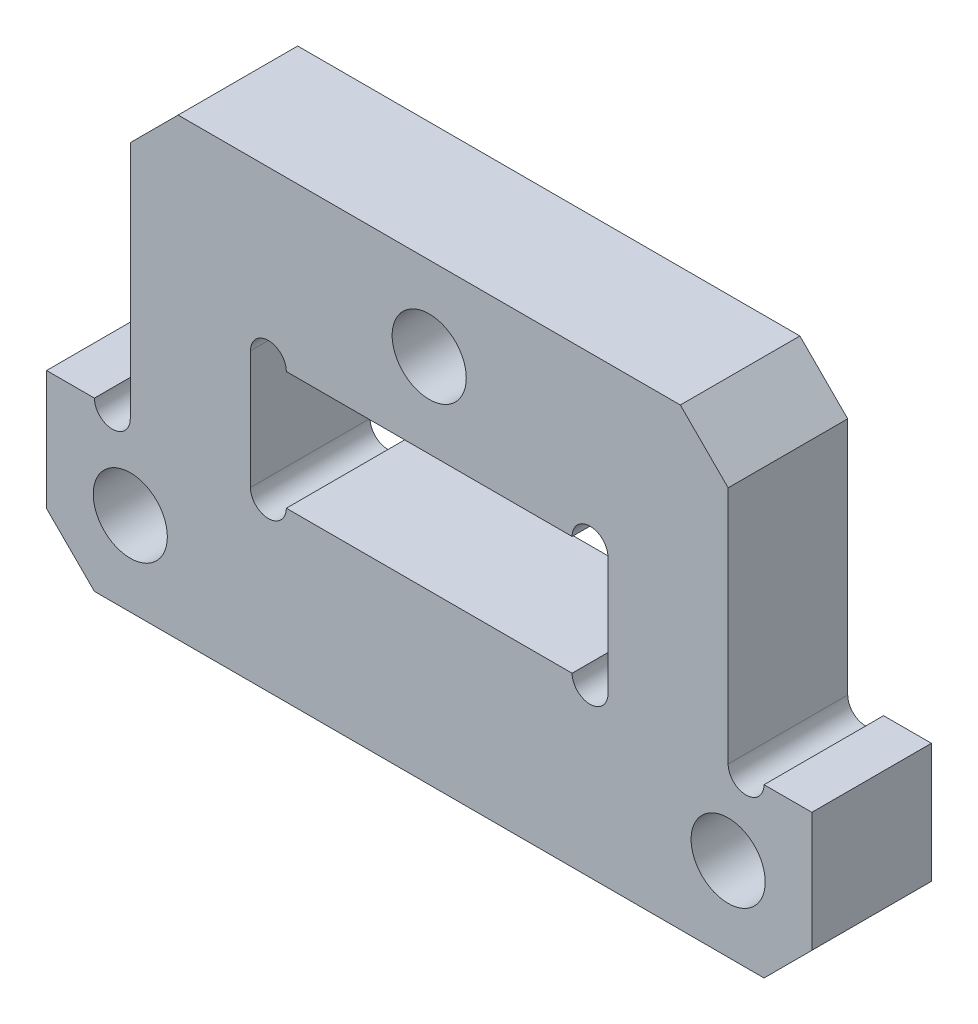
ISO-10303-21;
HEADER;
FILE_DESCRIPTION(('STEP AP214'),'2;1');
FILE_NAME('part.step','',(''),(''),'','','');
FILE_SCHEMA(('AUTOMOTIVE_DESIGN { 1 0 10303 214 1 1 1 1 }'));
ENDSEC;
DATA;
#1=APPLICATION_CONTEXT('core data for automotive mechanical design processes');
#2=APPLICATION_PROTOCOL_DEFINITION('international standard','automotive_design',2000,#1);
#3=PRODUCT_CONTEXT('',#1,'mechanical');
#4=PRODUCT('Part','Part','',(#3));
#5=PRODUCT_RELATED_PRODUCT_CATEGORY('part','',(#4));
#6=PRODUCT_DEFINITION_FORMATION('','',#4);
#7=PRODUCT_DEFINITION_CONTEXT('part definition',#1,'design');
#8=PRODUCT_DEFINITION('design','',#6,#7);
#9=PRODUCT_DEFINITION_SHAPE('','',#8);
#10=(LENGTH_UNIT() NAMED_UNIT(*) SI_UNIT(.MILLI.,.METRE.));
#11=(NAMED_UNIT(*) PLANE_ANGLE_UNIT() SI_UNIT($,.RADIAN.));
#12=(NAMED_UNIT(*) SI_UNIT($,.STERADIAN.) SOLID_ANGLE_UNIT());
#13=UNCERTAINTY_MEASURE_WITH_UNIT(LENGTH_MEASURE(1.E-05),#10,'distance_accuracy_value','');
#14=(GEOMETRIC_REPRESENTATION_CONTEXT(3) GLOBAL_UNCERTAINTY_ASSIGNED_CONTEXT((#13)) GLOBAL_UNIT_ASSIGNED_CONTEXT((#10,
#11,#12)) REPRESENTATION_CONTEXT('',''));
#15=CARTESIAN_POINT('',(0.,0.,0.));
#16=DIRECTION('',(0.,0.,1.));
#17=DIRECTION('',(1.,0.,0.));
#18=AXIS2_PLACEMENT_3D('',#15,#16,#17);
#19=CARTESIAN_POINT('',(0.,0.,2.5));
#20=DIRECTION('',(0.,0.,1.));
#21=DIRECTION('',(1.,0.,0.));
#22=AXIS2_PLACEMENT_3D('',#19,#20,#21);
#23=PLANE('',#22);
#24=DIRECTION('',(0.,1.,0.));
#25=VECTOR('',#24,1.);
#26=CARTESIAN_POINT('',(12.5,-2.5,2.5));
#27=LINE('',#26,#25);
#28=CARTESIAN_POINT('',(12.5,-2.5,2.5));
#29=VERTEX_POINT('',#28);
#30=CARTESIAN_POINT('',(12.5,7.49999999999999,2.5));
#31=VERTEX_POINT('',#30);
#32=EDGE_CURVE('E246',#29,#31,#27,.T.);
#33=ORIENTED_EDGE('',*,*,#32,.T.);
#34=DIRECTION('',(0.707106781186546,-0.707106781186549,0.));
#35=VECTOR('',#34,1.);
#36=CARTESIAN_POINT('',(10.,9.99999999999998,2.5));
#37=LINE('',#36,#35);
#38=CARTESIAN_POINT('',(10.5,9.5,2.5));
#39=VERTEX_POINT('',#38);
#40=EDGE_CURVE('E317',#31,#39,#37,.F.);
#41=ORIENTED_EDGE('',*,*,#40,.T.);
#42=DIRECTION('',(-1.,0.,0.));
#43=VECTOR('',#42,1.);
#44=CARTESIAN_POINT('',(12.5,9.5,2.5));
#45=LINE('',#44,#43);
#46=CARTESIAN_POINT('',(-10.5,9.5,2.5));
#47=VERTEX_POINT('',#46);
#48=EDGE_CURVE('E249',#39,#47,#45,.T.);
#49=ORIENTED_EDGE('',*,*,#48,.T.);
#50=DIRECTION('',(0.707106781186549,0.707106781186546,0.));
#51=VECTOR('',#50,1.);
#52=CARTESIAN_POINT('',(-9.99999999999998,10.,2.5));
#53=LINE('',#52,#51);
#54=CARTESIAN_POINT('',(-12.5,7.49999999999999,2.5));
#55=VERTEX_POINT('',#54);
#56=EDGE_CURVE('E51',#47,#55,#53,.F.);
#57=ORIENTED_EDGE('',*,*,#56,.T.);
#58=DIRECTION('',(0.,-1.,0.));
#59=VECTOR('',#58,1.);
#60=CARTESIAN_POINT('',(-12.5,-2.5,2.5));
#61=LINE('',#60,#59);
#62=CARTESIAN_POINT('',(-12.5,-2.5,2.5));
#63=VERTEX_POINT('',#62);
#64=EDGE_CURVE('E251',#55,#63,#61,.T.);
#65=ORIENTED_EDGE('',*,*,#64,.T.);
#66=CARTESIAN_POINT('',(-13.25,-2.5,2.5));
#67=DIRECTION('',(0.,0.,1.));
#68=DIRECTION('',(1.,0.,0.));
#69=AXIS2_PLACEMENT_3D('',#66,#67,#68);
#70=CIRCLE('',#69,0.75);
#71=CARTESIAN_POINT('',(-14.,-2.5,2.5));
#72=VERTEX_POINT('',#71);
#73=EDGE_CURVE('E383',#72,#63,#70,.T.);
#74=ORIENTED_EDGE('',*,*,#73,.F.);
#75=DIRECTION('',(-1.,0.,0.));
#76=VECTOR('',#75,1.);
#77=CARTESIAN_POINT('',(-16.,-2.5,2.5));
#78=LINE('',#77,#76);
#79=CARTESIAN_POINT('',(-16.,-2.5,2.5));
#80=VERTEX_POINT('',#79);
#81=EDGE_CURVE('E253',#72,#80,#78,.T.);
#82=ORIENTED_EDGE('',*,*,#81,.T.);
#83=DIRECTION('',(0.,-1.,0.));
#84=VECTOR('',#83,1.);
#85=CARTESIAN_POINT('',(-16.,-2.5,2.5));
#86=LINE('',#85,#84);
#87=CARTESIAN_POINT('',(-16.,-7.49999999999998,2.5));
#88=VERTEX_POINT('',#87);
#89=EDGE_CURVE('E255',#80,#88,#86,.T.);
#90=ORIENTED_EDGE('',*,*,#89,.T.);
#91=DIRECTION('',(-0.707106781186546,0.707106781186549,0.));
#92=VECTOR('',#91,1.);
#93=CARTESIAN_POINT('',(-11.75,-11.75,2.5));
#94=LINE('',#93,#92);
#95=CARTESIAN_POINT('',(-14.,-9.5,2.5));
#96=VERTEX_POINT('',#95);
#97=EDGE_CURVE('E313',#88,#96,#94,.F.);
#98=ORIENTED_EDGE('',*,*,#97,.T.);
#99=DIRECTION('',(1.,0.,0.));
#100=VECTOR('',#99,1.);
#101=CARTESIAN_POINT('',(-16.,-9.5,2.5));
#102=LINE('',#101,#100);
#103=CARTESIAN_POINT('',(14.,-9.5,2.5));
#104=VERTEX_POINT('',#103);
#105=EDGE_CURVE('E238',#96,#104,#102,.T.);
#106=ORIENTED_EDGE('',*,*,#105,.T.);
#107=DIRECTION('',(-0.707106781186549,-0.707106781186546,0.));
#108=VECTOR('',#107,1.);
#109=CARTESIAN_POINT('',(11.75,-11.75,2.5));
#110=LINE('',#109,#108);
#111=CARTESIAN_POINT('',(16.,-7.49999999999999,2.5));
#112=VERTEX_POINT('',#111);
#113=EDGE_CURVE('E58',#104,#112,#110,.F.);
#114=ORIENTED_EDGE('',*,*,#113,.T.);
#115=DIRECTION('',(0.,1.,0.));
#116=VECTOR('',#115,1.);
#117=CARTESIAN_POINT('',(16.,-9.5,2.5));
#118=LINE('',#117,#116);
#119=CARTESIAN_POINT('',(16.,-2.5,2.5));
#120=VERTEX_POINT('',#119);
#121=EDGE_CURVE('E240',#112,#120,#118,.T.);
#122=ORIENTED_EDGE('',*,*,#121,.T.);
#123=DIRECTION('',(-1.,0.,0.));
#124=VECTOR('',#123,1.);
#125=CARTESIAN_POINT('',(16.,-2.5,2.5));
#126=LINE('',#125,#124);
#127=CARTESIAN_POINT('',(14.,-2.5,2.5));
#128=VERTEX_POINT('',#127);
#129=EDGE_CURVE('E243',#120,#128,#126,.T.);
#130=ORIENTED_EDGE('',*,*,#129,.T.);
#131=CARTESIAN_POINT('',(13.25,-2.5,2.5));
#132=DIRECTION('',(0.,0.,1.));
#133=DIRECTION('',(1.,0.,0.));
#134=AXIS2_PLACEMENT_3D('',#131,#132,#133);
#135=CIRCLE('',#134,0.75);
#136=EDGE_CURVE('E355',#29,#128,#135,.T.);
#137=ORIENTED_EDGE('',*,*,#136,.F.);
#138=EDGE_LOOP('',(#33,#41,#49,#57,#65,#74,#82,#90,#98,#106,#114,#122,#130,#137));
#139=FACE_BOUND('',#138,.T.);
#140=CARTESIAN_POINT('',(-6.725,-2.475,2.5));
#141=DIRECTION('',(0.,0.,1.));
#142=DIRECTION('',(1.,0.,0.));
#143=AXIS2_PLACEMENT_3D('',#140,#141,#142);
#144=CIRCLE('',#143,0.75);
#145=CARTESIAN_POINT('',(-7.475,-2.475,2.5));
#146=VERTEX_POINT('',#145);
#147=CARTESIAN_POINT('',(-5.975,-2.475,2.5));
#148=VERTEX_POINT('',#147);
#149=EDGE_CURVE('E392',#146,#148,#144,.T.);
#150=ORIENTED_EDGE('',*,*,#149,.F.);
#151=DIRECTION('',(0.,-1.,0.));
#152=VECTOR('',#151,1.);
#153=CARTESIAN_POINT('',(-7.475,-2.475,2.5));
#154=LINE('',#153,#152);
#155=CARTESIAN_POINT('',(-7.475,2.475,2.5));
#156=VERTEX_POINT('',#155);
#157=EDGE_CURVE('E216',#156,#146,#154,.T.);
#158=ORIENTED_EDGE('',*,*,#157,.F.);
#159=CARTESIAN_POINT('',(-6.725,2.475,2.5));
#160=DIRECTION('',(0.,0.,1.));
#161=DIRECTION('',(1.,0.,0.));
#162=AXIS2_PLACEMENT_3D('',#159,#160,#161);
#163=CIRCLE('',#162,0.75);
#164=CARTESIAN_POINT('',(-5.975,2.475,2.5));
#165=VERTEX_POINT('',#164);
#166=EDGE_CURVE('E397',#165,#156,#163,.T.);
#167=ORIENTED_EDGE('',*,*,#166,.F.);
#168=DIRECTION('',(-1.,0.,0.));
#169=VECTOR('',#168,1.);
#170=CARTESIAN_POINT('',(7.475,2.475,2.5));
#171=LINE('',#170,#169);
#172=CARTESIAN_POINT('',(5.975,2.475,2.5));
#173=VERTEX_POINT('',#172);
#174=EDGE_CURVE('E207',#173,#165,#171,.T.);
#175=ORIENTED_EDGE('',*,*,#174,.F.);
#176=CARTESIAN_POINT('',(6.725,2.475,2.5));
#177=DIRECTION('',(0.,0.,1.));
#178=DIRECTION('',(1.,0.,0.));
#179=AXIS2_PLACEMENT_3D('',#176,#177,#178);
#180=CIRCLE('',#179,0.75);
#181=CARTESIAN_POINT('',(7.475,2.475,2.5));
#182=VERTEX_POINT('',#181);
#183=EDGE_CURVE('E187',#182,#173,#180,.T.);
#184=ORIENTED_EDGE('',*,*,#183,.F.);
#185=DIRECTION('',(0.,1.,0.));
#186=VECTOR('',#185,1.);
#187=CARTESIAN_POINT('',(7.475,-2.475,2.5));
#188=LINE('',#187,#186);
#189=CARTESIAN_POINT('',(7.475,-2.475,2.5));
#190=VERTEX_POINT('',#189);
#191=EDGE_CURVE('E204',#190,#182,#188,.T.);
#192=ORIENTED_EDGE('',*,*,#191,.F.);
#193=CARTESIAN_POINT('',(6.725,-2.475,2.5));
#194=DIRECTION('',(0.,0.,1.));
#195=DIRECTION('',(1.,0.,0.));
#196=AXIS2_PLACEMENT_3D('',#193,#194,#195);
#197=CIRCLE('',#196,0.75);
#198=CARTESIAN_POINT('',(5.975,-2.475,2.5));
#199=VERTEX_POINT('',#198);
#200=EDGE_CURVE('E402',#199,#190,#197,.T.);
#201=ORIENTED_EDGE('',*,*,#200,.F.);
#202=DIRECTION('',(1.,0.,0.));
#203=VECTOR('',#202,1.);
#204=CARTESIAN_POINT('',(7.475,-2.475,2.5));
#205=LINE('',#204,#203);
#206=EDGE_CURVE('E212',#148,#199,#205,.T.);
#207=ORIENTED_EDGE('',*,*,#206,.F.);
#208=EDGE_LOOP('',(#150,#158,#167,#175,#184,#192,#201,#207));
#209=FACE_BOUND('',#208,.T.);
#210=CARTESIAN_POINT('',(12.5,-6.,2.5));
#211=DIRECTION('',(0.,0.,1.));
#212=DIRECTION('',(1.,0.,0.));
#213=AXIS2_PLACEMENT_3D('',#210,#211,#212);
#214=CIRCLE('',#213,1.55);
#215=CARTESIAN_POINT('',(14.05,-6.,2.5));
#216=VERTEX_POINT('',#215);
#217=EDGE_CURVE('E413',#216,#216,#214,.T.);
#218=ORIENTED_EDGE('',*,*,#217,.F.);
#219=EDGE_LOOP('',(#218));
#220=FACE_BOUND('',#219,.T.);
#221=CARTESIAN_POINT('',(-12.5,-6.,2.5));
#222=DIRECTION('',(0.,0.,1.));
#223=DIRECTION('',(1.,0.,0.));
#224=AXIS2_PLACEMENT_3D('',#221,#222,#223);
#225=CIRCLE('',#224,1.55);
#226=CARTESIAN_POINT('',(-10.95,-6.,2.5));
#227=VERTEX_POINT('',#226);
#228=EDGE_CURVE('E224',#227,#227,#225,.T.);
#229=ORIENTED_EDGE('',*,*,#228,.F.);
#230=EDGE_LOOP('',(#229));
#231=FACE_BOUND('',#230,.T.);
#232=CARTESIAN_POINT('',(0.,6.,2.5));
#233=DIRECTION('',(0.,0.,1.));
#234=DIRECTION('',(1.,0.,0.));
#235=AXIS2_PLACEMENT_3D('',#232,#233,#234);
#236=CIRCLE('',#235,1.55);
#237=CARTESIAN_POINT('',(1.55,6.,2.5));
#238=VERTEX_POINT('',#237);
#239=EDGE_CURVE('E407',#238,#238,#236,.T.);
#240=ORIENTED_EDGE('',*,*,#239,.F.);
#241=EDGE_LOOP('',(#240));
#242=FACE_BOUND('',#241,.T.);
#243=ADVANCED_FACE('F35',(#139,#209,#220,#231,#242),#23,.T.);
#244=CARTESIAN_POINT('',(0.,0.,-2.5));
#245=DIRECTION('',(0.,0.,1.));
#246=DIRECTION('',(1.,0.,0.));
#247=AXIS2_PLACEMENT_3D('',#244,#245,#246);
#248=PLANE('',#247);
#249=DIRECTION('',(-1.,0.,0.));
#250=VECTOR('',#249,1.);
#251=CARTESIAN_POINT('',(12.5,9.5,-2.5));
#252=LINE('',#251,#250);
#253=CARTESIAN_POINT('',(10.5,9.5,-2.5));
#254=VERTEX_POINT('',#253);
#255=CARTESIAN_POINT('',(-10.5,9.5,-2.5));
#256=VERTEX_POINT('',#255);
#257=EDGE_CURVE('E269',#254,#256,#252,.T.);
#258=ORIENTED_EDGE('',*,*,#257,.F.);
#259=DIRECTION('',(-0.707106781186546,0.707106781186549,0.));
#260=VECTOR('',#259,1.);
#261=CARTESIAN_POINT('',(10.5,9.5,-2.5));
#262=LINE('',#261,#260);
#263=CARTESIAN_POINT('',(12.5,7.49999999999999,-2.5));
#264=VERTEX_POINT('',#263);
#265=EDGE_CURVE('E309',#254,#264,#262,.F.);
#266=ORIENTED_EDGE('',*,*,#265,.T.);
#267=DIRECTION('',(0.,1.,0.));
#268=VECTOR('',#267,1.);
#269=CARTESIAN_POINT('',(12.5,-2.5,-2.5));
#270=LINE('',#269,#268);
#271=CARTESIAN_POINT('',(12.5,-2.5,-2.5));
#272=VERTEX_POINT('',#271);
#273=EDGE_CURVE('E266',#272,#264,#270,.T.);
#274=ORIENTED_EDGE('',*,*,#273,.F.);
#275=CARTESIAN_POINT('',(13.25,-2.5,-2.5));
#276=DIRECTION('',(0.,0.,1.));
#277=DIRECTION('',(1.,0.,0.));
#278=AXIS2_PLACEMENT_3D('',#275,#276,#277);
#279=CIRCLE('',#278,0.75);
#280=CARTESIAN_POINT('',(14.,-2.5,-2.5));
#281=VERTEX_POINT('',#280);
#282=EDGE_CURVE('E348',#272,#281,#279,.T.);
#283=ORIENTED_EDGE('',*,*,#282,.T.);
#284=DIRECTION('',(-1.,0.,0.));
#285=VECTOR('',#284,1.);
#286=CARTESIAN_POINT('',(16.,-2.5,-2.5));
#287=LINE('',#286,#285);
#288=CARTESIAN_POINT('',(16.,-2.5,-2.5));
#289=VERTEX_POINT('',#288);
#290=EDGE_CURVE('E263',#289,#281,#287,.T.);
#291=ORIENTED_EDGE('',*,*,#290,.F.);
#292=DIRECTION('',(0.,1.,0.));
#293=VECTOR('',#292,1.);
#294=CARTESIAN_POINT('',(16.,-9.5,-2.5));
#295=LINE('',#294,#293);
#296=CARTESIAN_POINT('',(16.,-7.49999999999999,-2.5));
#297=VERTEX_POINT('',#296);
#298=EDGE_CURVE('E261',#297,#289,#295,.T.);
#299=ORIENTED_EDGE('',*,*,#298,.F.);
#300=DIRECTION('',(0.707106781186549,0.707106781186546,0.));
#301=VECTOR('',#300,1.);
#302=CARTESIAN_POINT('',(16.,-7.49999999999999,-2.5));
#303=LINE('',#302,#301);
#304=CARTESIAN_POINT('',(14.,-9.5,-2.5));
#305=VERTEX_POINT('',#304);
#306=EDGE_CURVE('E305',#297,#305,#303,.F.);
#307=ORIENTED_EDGE('',*,*,#306,.T.);
#308=DIRECTION('',(1.,0.,0.));
#309=VECTOR('',#308,1.);
#310=CARTESIAN_POINT('',(-16.,-9.5,-2.5));
#311=LINE('',#310,#309);
#312=CARTESIAN_POINT('',(-14.,-9.5,-2.5));
#313=VERTEX_POINT('',#312);
#314=EDGE_CURVE('E237',#313,#305,#311,.T.);
#315=ORIENTED_EDGE('',*,*,#314,.F.);
#316=DIRECTION('',(0.707106781186546,-0.707106781186549,0.));
#317=VECTOR('',#316,1.);
#318=CARTESIAN_POINT('',(-14.,-9.5,-2.5));
#319=LINE('',#318,#317);
#320=CARTESIAN_POINT('',(-16.,-7.49999999999998,-2.5));
#321=VERTEX_POINT('',#320);
#322=EDGE_CURVE('E303',#313,#321,#319,.F.);
#323=ORIENTED_EDGE('',*,*,#322,.T.);
#324=DIRECTION('',(0.,-1.,0.));
#325=VECTOR('',#324,1.);
#326=CARTESIAN_POINT('',(-16.,-2.5,-2.5));
#327=LINE('',#326,#325);
#328=CARTESIAN_POINT('',(-16.,-2.5,-2.5));
#329=VERTEX_POINT('',#328);
#330=EDGE_CURVE('E241',#329,#321,#327,.T.);
#331=ORIENTED_EDGE('',*,*,#330,.F.);
#332=DIRECTION('',(-1.,0.,0.));
#333=VECTOR('',#332,1.);
#334=CARTESIAN_POINT('',(-16.,-2.5,-2.5));
#335=LINE('',#334,#333);
#336=CARTESIAN_POINT('',(-14.,-2.5,-2.5));
#337=VERTEX_POINT('',#336);
#338=EDGE_CURVE('E274',#337,#329,#335,.T.);
#339=ORIENTED_EDGE('',*,*,#338,.F.);
#340=CARTESIAN_POINT('',(-13.25,-2.5,-2.5));
#341=DIRECTION('',(0.,0.,1.));
#342=DIRECTION('',(1.,0.,0.));
#343=AXIS2_PLACEMENT_3D('',#340,#341,#342);
#344=CIRCLE('',#343,0.75);
#345=CARTESIAN_POINT('',(-12.5,-2.5,-2.5));
#346=VERTEX_POINT('',#345);
#347=EDGE_CURVE('E379',#337,#346,#344,.T.);
#348=ORIENTED_EDGE('',*,*,#347,.T.);
#349=DIRECTION('',(0.,-1.,0.));
#350=VECTOR('',#349,1.);
#351=CARTESIAN_POINT('',(-12.5,-2.5,-2.5));
#352=LINE('',#351,#350);
#353=CARTESIAN_POINT('',(-12.5,7.49999999999999,-2.5));
#354=VERTEX_POINT('',#353);
#355=EDGE_CURVE('E272',#354,#346,#352,.T.);
#356=ORIENTED_EDGE('',*,*,#355,.F.);
#357=DIRECTION('',(-0.707106781186549,-0.707106781186546,0.));
#358=VECTOR('',#357,1.);
#359=CARTESIAN_POINT('',(-12.5,7.49999999999999,-2.5));
#360=LINE('',#359,#358);
#361=EDGE_CURVE('E307',#354,#256,#360,.F.);
#362=ORIENTED_EDGE('',*,*,#361,.T.);
#363=EDGE_LOOP('',(#258,#266,#274,#283,#291,#299,#307,#315,#323,#331,#339,#348,#356,#362));
#364=FACE_BOUND('',#363,.T.);
#365=DIRECTION('',(0.,-1.,0.));
#366=VECTOR('',#365,1.);
#367=CARTESIAN_POINT('',(-7.475,-2.475,-2.5));
#368=LINE('',#367,#366);
#369=CARTESIAN_POINT('',(-7.475,2.475,-2.5));
#370=VERTEX_POINT('',#369);
#371=CARTESIAN_POINT('',(-7.475,-2.475,-2.5));
#372=VERTEX_POINT('',#371);
#373=EDGE_CURVE('E220',#370,#372,#368,.T.);
#374=ORIENTED_EDGE('',*,*,#373,.T.);
#375=CARTESIAN_POINT('',(-6.725,-2.475,-2.5));
#376=DIRECTION('',(0.,0.,1.));
#377=DIRECTION('',(1.,0.,0.));
#378=AXIS2_PLACEMENT_3D('',#375,#376,#377);
#379=CIRCLE('',#378,0.75);
#380=CARTESIAN_POINT('',(-5.975,-2.475,-2.5));
#381=VERTEX_POINT('',#380);
#382=EDGE_CURVE('E387',#372,#381,#379,.T.);
#383=ORIENTED_EDGE('',*,*,#382,.T.);
#384=DIRECTION('',(1.,0.,0.));
#385=VECTOR('',#384,1.);
#386=CARTESIAN_POINT('',(7.475,-2.475,-2.5));
#387=LINE('',#386,#385);
#388=CARTESIAN_POINT('',(5.975,-2.475,-2.5));
#389=VERTEX_POINT('',#388);
#390=EDGE_CURVE('E223',#381,#389,#387,.T.);
#391=ORIENTED_EDGE('',*,*,#390,.T.);
#392=CARTESIAN_POINT('',(6.725,-2.475,-2.5));
#393=DIRECTION('',(0.,0.,1.));
#394=DIRECTION('',(1.,0.,0.));
#395=AXIS2_PLACEMENT_3D('',#392,#393,#394);
#396=CIRCLE('',#395,0.75);
#397=CARTESIAN_POINT('',(7.475,-2.475,-2.5));
#398=VERTEX_POINT('',#397);
#399=EDGE_CURVE('E208',#389,#398,#396,.T.);
#400=ORIENTED_EDGE('',*,*,#399,.T.);
#401=DIRECTION('',(0.,1.,0.));
#402=VECTOR('',#401,1.);
#403=CARTESIAN_POINT('',(7.475,-2.475,-2.5));
#404=LINE('',#403,#402);
#405=CARTESIAN_POINT('',(7.475,2.475,-2.5));
#406=VERTEX_POINT('',#405);
#407=EDGE_CURVE('E227',#398,#406,#404,.T.);
#408=ORIENTED_EDGE('',*,*,#407,.T.);
#409=CARTESIAN_POINT('',(6.725,2.475,-2.5));
#410=DIRECTION('',(0.,0.,1.));
#411=DIRECTION('',(1.,0.,0.));
#412=AXIS2_PLACEMENT_3D('',#409,#410,#411);
#413=CIRCLE('',#412,0.75);
#414=CARTESIAN_POINT('',(5.975,2.475,-2.5));
#415=VERTEX_POINT('',#414);
#416=EDGE_CURVE('E190',#406,#415,#413,.T.);
#417=ORIENTED_EDGE('',*,*,#416,.T.);
#418=DIRECTION('',(-1.,0.,0.));
#419=VECTOR('',#418,1.);
#420=CARTESIAN_POINT('',(7.475,2.475,-2.5));
#421=LINE('',#420,#419);
#422=CARTESIAN_POINT('',(-5.975,2.475,-2.5));
#423=VERTEX_POINT('',#422);
#424=EDGE_CURVE('E229',#415,#423,#421,.T.);
#425=ORIENTED_EDGE('',*,*,#424,.T.);
#426=CARTESIAN_POINT('',(-6.725,2.475,-2.5));
#427=DIRECTION('',(0.,0.,1.));
#428=DIRECTION('',(1.,0.,0.));
#429=AXIS2_PLACEMENT_3D('',#426,#427,#428);
#430=CIRCLE('',#429,0.75);
#431=EDGE_CURVE('E394',#423,#370,#430,.T.);
#432=ORIENTED_EDGE('',*,*,#431,.T.);
#433=EDGE_LOOP('',(#374,#383,#391,#400,#408,#417,#425,#432));
#434=FACE_BOUND('',#433,.T.);
#435=CARTESIAN_POINT('',(-12.5,-6.,-2.5));
#436=DIRECTION('',(0.,0.,1.));
#437=DIRECTION('',(1.,0.,0.));
#438=AXIS2_PLACEMENT_3D('',#435,#436,#437);
#439=CIRCLE('',#438,1.55);
#440=CARTESIAN_POINT('',(-10.95,-6.,-2.5));
#441=VERTEX_POINT('',#440);
#442=EDGE_CURVE('E416',#441,#441,#439,.T.);
#443=ORIENTED_EDGE('',*,*,#442,.T.);
#444=EDGE_LOOP('',(#443));
#445=FACE_BOUND('',#444,.T.);
#446=CARTESIAN_POINT('',(12.5,-6.,-2.5));
#447=DIRECTION('',(0.,0.,1.));
#448=DIRECTION('',(1.,0.,0.));
#449=AXIS2_PLACEMENT_3D('',#446,#447,#448);
#450=CIRCLE('',#449,1.55);
#451=CARTESIAN_POINT('',(14.05,-6.,-2.5));
#452=VERTEX_POINT('',#451);
#453=EDGE_CURVE('E410',#452,#452,#450,.T.);
#454=ORIENTED_EDGE('',*,*,#453,.T.);
#455=EDGE_LOOP('',(#454));
#456=FACE_BOUND('',#455,.T.);
#457=CARTESIAN_POINT('',(0.,6.,-2.5));
#458=DIRECTION('',(0.,0.,1.));
#459=DIRECTION('',(1.,0.,0.));
#460=AXIS2_PLACEMENT_3D('',#457,#458,#459);
#461=CIRCLE('',#460,1.55);
#462=CARTESIAN_POINT('',(1.55,6.,-2.5));
#463=VERTEX_POINT('',#462);
#464=EDGE_CURVE('E406',#463,#463,#461,.T.);
#465=ORIENTED_EDGE('',*,*,#464,.T.);
#466=EDGE_LOOP('',(#465));
#467=FACE_BOUND('',#466,.T.);
#468=ADVANCED_FACE('F344',(#364,#434,#445,#456,#467),#248,.F.);
#469=CARTESIAN_POINT('',(-16.,-9.5,2.5));
#470=DIRECTION('',(0.,1.,0.));
#471=DIRECTION('',(0.,0.,1.));
#472=AXIS2_PLACEMENT_3D('',#469,#470,#471);
#473=PLANE('',#472);
#474=ORIENTED_EDGE('',*,*,#314,.T.);
#475=DIRECTION('',(0.,0.,1.));
#476=VECTOR('',#475,1.);
#477=CARTESIAN_POINT('',(14.,-9.5,2.5));
#478=LINE('',#477,#476);
#479=EDGE_CURVE('E44',#305,#104,#478,.T.);
#480=ORIENTED_EDGE('',*,*,#479,.T.);
#481=ORIENTED_EDGE('',*,*,#105,.F.);
#482=DIRECTION('',(0.,0.,-1.));
#483=VECTOR('',#482,1.);
#484=CARTESIAN_POINT('',(-14.,-9.5,2.5));
#485=LINE('',#484,#483);
#486=EDGE_CURVE('E325',#96,#313,#485,.T.);
#487=ORIENTED_EDGE('',*,*,#486,.T.);
#488=EDGE_LOOP('',(#474,#480,#481,#487));
#489=FACE_BOUND('',#488,.T.);
#490=ADVANCED_FACE('F330',(#489),#473,.F.);
#491=CARTESIAN_POINT('',(16.,-9.5,2.5));
#492=DIRECTION('',(-1.,0.,0.));
#493=DIRECTION('',(0.,-1.,0.));
#494=AXIS2_PLACEMENT_3D('',#491,#492,#493);
#495=PLANE('',#494);
#496=ORIENTED_EDGE('',*,*,#121,.F.);
#497=DIRECTION('',(0.,0.,-1.));
#498=VECTOR('',#497,1.);
#499=CARTESIAN_POINT('',(16.,-7.49999999999999,2.5));
#500=LINE('',#499,#498);
#501=EDGE_CURVE('E322',#112,#297,#500,.T.);
#502=ORIENTED_EDGE('',*,*,#501,.T.);
#503=ORIENTED_EDGE('',*,*,#298,.T.);
#504=DIRECTION('',(0.,0.,-1.));
#505=VECTOR('',#504,1.);
#506=CARTESIAN_POINT('',(16.,-2.5,2.5));
#507=LINE('',#506,#505);
#508=EDGE_CURVE('E286',#120,#289,#507,.T.);
#509=ORIENTED_EDGE('',*,*,#508,.F.);
#510=EDGE_LOOP('',(#496,#502,#503,#509));
#511=FACE_BOUND('',#510,.T.);
#512=ADVANCED_FACE('F339',(#511),#495,.F.);
#513=CARTESIAN_POINT('',(16.,-2.5,2.5));
#514=DIRECTION('',(0.,-1.,0.));
#515=DIRECTION('',(1.,0.,0.));
#516=AXIS2_PLACEMENT_3D('',#513,#514,#515);
#517=PLANE('',#516);
#518=ORIENTED_EDGE('',*,*,#290,.T.);
#519=DIRECTION('',(0.,0.,1.));
#520=VECTOR('',#519,1.);
#521=CARTESIAN_POINT('',(14.,-2.5,-2.5));
#522=LINE('',#521,#520);
#523=EDGE_CURVE('E353',#281,#128,#522,.T.);
#524=ORIENTED_EDGE('',*,*,#523,.T.);
#525=ORIENTED_EDGE('',*,*,#129,.F.);
#526=ORIENTED_EDGE('',*,*,#508,.T.);
#527=EDGE_LOOP('',(#518,#524,#525,#526));
#528=FACE_BOUND('',#527,.T.);
#529=ADVANCED_FACE('F351',(#528),#517,.F.);
#530=CARTESIAN_POINT('',(12.5,-2.5,2.5));
#531=DIRECTION('',(-1.,0.,0.));
#532=DIRECTION('',(0.,0.,1.));
#533=AXIS2_PLACEMENT_3D('',#530,#531,#532);
#534=PLANE('',#533);
#535=ORIENTED_EDGE('',*,*,#273,.T.);
#536=DIRECTION('',(0.,0.,1.));
#537=VECTOR('',#536,1.);
#538=CARTESIAN_POINT('',(12.5,7.49999999999999,2.5));
#539=LINE('',#538,#537);
#540=EDGE_CURVE('E311',#264,#31,#539,.T.);
#541=ORIENTED_EDGE('',*,*,#540,.T.);
#542=ORIENTED_EDGE('',*,*,#32,.F.);
#543=DIRECTION('',(0.,0.,-1.));
#544=VECTOR('',#543,1.);
#545=CARTESIAN_POINT('',(12.5,-2.5,2.5));
#546=LINE('',#545,#544);
#547=EDGE_CURVE('E283',#29,#272,#546,.T.);
#548=ORIENTED_EDGE('',*,*,#547,.T.);
#549=EDGE_LOOP('',(#535,#541,#542,#548));
#550=FACE_BOUND('',#549,.T.);
#551=ADVANCED_FACE('F361',(#550),#534,.F.);
#552=CARTESIAN_POINT('',(12.5,9.5,2.5));
#553=DIRECTION('',(0.,-1.,0.));
#554=DIRECTION('',(0.,0.,-1.));
#555=AXIS2_PLACEMENT_3D('',#552,#553,#554);
#556=PLANE('',#555);
#557=ORIENTED_EDGE('',*,*,#48,.F.);
#558=DIRECTION('',(0.,0.,-1.));
#559=VECTOR('',#558,1.);
#560=CARTESIAN_POINT('',(10.5,9.5,2.5));
#561=LINE('',#560,#559);
#562=EDGE_CURVE('E300',#39,#254,#561,.T.);
#563=ORIENTED_EDGE('',*,*,#562,.T.);
#564=ORIENTED_EDGE('',*,*,#257,.T.);
#565=DIRECTION('',(0.,0.,1.));
#566=VECTOR('',#565,1.);
#567=CARTESIAN_POINT('',(-10.5,9.5,2.5));
#568=LINE('',#567,#566);
#569=EDGE_CURVE('E298',#256,#47,#568,.T.);
#570=ORIENTED_EDGE('',*,*,#569,.T.);
#571=EDGE_LOOP('',(#557,#563,#564,#570));
#572=FACE_BOUND('',#571,.T.);
#573=ADVANCED_FACE('F368',(#572),#556,.F.);
#574=CARTESIAN_POINT('',(-12.5,-2.5,2.5));
#575=DIRECTION('',(1.,0.,0.));
#576=DIRECTION('',(0.,0.,-1.));
#577=AXIS2_PLACEMENT_3D('',#574,#575,#576);
#578=PLANE('',#577);
#579=ORIENTED_EDGE('',*,*,#64,.F.);
#580=DIRECTION('',(0.,0.,-1.));
#581=VECTOR('',#580,1.);
#582=CARTESIAN_POINT('',(-12.5,7.49999999999999,2.5));
#583=LINE('',#582,#581);
#584=EDGE_CURVE('E319',#55,#354,#583,.T.);
#585=ORIENTED_EDGE('',*,*,#584,.T.);
#586=ORIENTED_EDGE('',*,*,#355,.T.);
#587=DIRECTION('',(0.,0.,-1.));
#588=VECTOR('',#587,1.);
#589=CARTESIAN_POINT('',(-12.5,-2.5,2.5));
#590=LINE('',#589,#588);
#591=EDGE_CURVE('E280',#63,#346,#590,.T.);
#592=ORIENTED_EDGE('',*,*,#591,.F.);
#593=EDGE_LOOP('',(#579,#585,#586,#592));
#594=FACE_BOUND('',#593,.T.);
#595=ADVANCED_FACE('F375',(#594),#578,.F.);
#596=CARTESIAN_POINT('',(-16.,-2.5,2.5));
#597=DIRECTION('',(0.,-1.,0.));
#598=DIRECTION('',(1.,0.,0.));
#599=AXIS2_PLACEMENT_3D('',#596,#597,#598);
#600=PLANE('',#599);
#601=ORIENTED_EDGE('',*,*,#81,.F.);
#602=DIRECTION('',(0.,0.,1.));
#603=VECTOR('',#602,1.);
#604=CARTESIAN_POINT('',(-14.,-2.5,-2.5));
#605=LINE('',#604,#603);
#606=EDGE_CURVE('E295',#72,#337,#605,.F.);
#607=ORIENTED_EDGE('',*,*,#606,.T.);
#608=ORIENTED_EDGE('',*,*,#338,.T.);
#609=DIRECTION('',(0.,0.,-1.));
#610=VECTOR('',#609,1.);
#611=CARTESIAN_POINT('',(-16.,-2.5,2.5));
#612=LINE('',#611,#610);
#613=EDGE_CURVE('E258',#80,#329,#612,.T.);
#614=ORIENTED_EDGE('',*,*,#613,.F.);
#615=EDGE_LOOP('',(#601,#607,#608,#614));
#616=FACE_BOUND('',#615,.T.);
#617=ADVANCED_FACE('F466',(#616),#600,.F.);
#618=CARTESIAN_POINT('',(-16.,-2.5,2.5));
#619=DIRECTION('',(1.,0.,0.));
#620=DIRECTION('',(0.,1.,0.));
#621=AXIS2_PLACEMENT_3D('',#618,#619,#620);
#622=PLANE('',#621);
#623=ORIENTED_EDGE('',*,*,#330,.T.);
#624=DIRECTION('',(0.,0.,1.));
#625=VECTOR('',#624,1.);
#626=CARTESIAN_POINT('',(-16.,-7.49999999999999,2.5));
#627=LINE('',#626,#625);
#628=EDGE_CURVE('E11',#321,#88,#627,.T.);
#629=ORIENTED_EDGE('',*,*,#628,.T.);
#630=ORIENTED_EDGE('',*,*,#89,.F.);
#631=ORIENTED_EDGE('',*,*,#613,.T.);
#632=EDGE_LOOP('',(#623,#629,#630,#631));
#633=FACE_BOUND('',#632,.T.);
#634=ADVANCED_FACE('F463',(#633),#622,.F.);
#635=CARTESIAN_POINT('',(-7.475,-2.475,2.5));
#636=DIRECTION('',(1.,0.,0.));
#637=DIRECTION('',(0.,0.,-1.));
#638=AXIS2_PLACEMENT_3D('',#635,#636,#637);
#639=PLANE('',#638);
#640=ORIENTED_EDGE('',*,*,#373,.F.);
#641=DIRECTION('',(0.,0.,-1.));
#642=VECTOR('',#641,1.);
#643=CARTESIAN_POINT('',(-7.475,2.475,2.5));
#644=LINE('',#643,#642);
#645=EDGE_CURVE('E196',#156,#370,#644,.T.);
#646=ORIENTED_EDGE('',*,*,#645,.F.);
#647=ORIENTED_EDGE('',*,*,#157,.T.);
#648=DIRECTION('',(0.,0.,-1.));
#649=VECTOR('',#648,1.);
#650=CARTESIAN_POINT('',(-7.475,-2.475,2.5));
#651=LINE('',#650,#649);
#652=EDGE_CURVE('E234',#146,#372,#651,.T.);
#653=ORIENTED_EDGE('',*,*,#652,.T.);
#654=EDGE_LOOP('',(#640,#646,#647,#653));
#655=FACE_BOUND('',#654,.T.);
#656=ADVANCED_FACE('F427',(#655),#639,.T.);
#657=CARTESIAN_POINT('',(7.475,-2.475,2.5));
#658=DIRECTION('',(0.,1.,0.));
#659=DIRECTION('',(-1.,0.,0.));
#660=AXIS2_PLACEMENT_3D('',#657,#658,#659);
#661=PLANE('',#660);
#662=DIRECTION('',(0.,0.,1.));
#663=VECTOR('',#662,1.);
#664=CARTESIAN_POINT('',(-5.975,-2.475,-2.5));
#665=LINE('',#664,#663);
#666=EDGE_CURVE('E293',#148,#381,#665,.F.);
#667=ORIENTED_EDGE('',*,*,#666,.F.);
#668=ORIENTED_EDGE('',*,*,#206,.T.);
#669=DIRECTION('',(0.,0.,1.));
#670=VECTOR('',#669,1.);
#671=CARTESIAN_POINT('',(5.975,-2.475,-2.5));
#672=LINE('',#671,#670);
#673=EDGE_CURVE('E382',#389,#199,#672,.T.);
#674=ORIENTED_EDGE('',*,*,#673,.F.);
#675=ORIENTED_EDGE('',*,*,#390,.F.);
#676=EDGE_LOOP('',(#667,#668,#674,#675));
#677=FACE_BOUND('',#676,.T.);
#678=ADVANCED_FACE('F434',(#677),#661,.T.);
#679=CARTESIAN_POINT('',(7.475,-2.475,2.5));
#680=DIRECTION('',(-1.,0.,0.));
#681=DIRECTION('',(0.,0.,1.));
#682=AXIS2_PLACEMENT_3D('',#679,#680,#681);
#683=PLANE('',#682);
#684=ORIENTED_EDGE('',*,*,#407,.F.);
#685=DIRECTION('',(0.,0.,-1.));
#686=VECTOR('',#685,1.);
#687=CARTESIAN_POINT('',(7.475,-2.475,2.5));
#688=LINE('',#687,#686);
#689=EDGE_CURVE('E195',#190,#398,#688,.T.);
#690=ORIENTED_EDGE('',*,*,#689,.F.);
#691=ORIENTED_EDGE('',*,*,#191,.T.);
#692=DIRECTION('',(0.,0.,-1.));
#693=VECTOR('',#692,1.);
#694=CARTESIAN_POINT('',(7.475,2.475,2.5));
#695=LINE('',#694,#693);
#696=EDGE_CURVE('E184',#182,#406,#695,.T.);
#697=ORIENTED_EDGE('',*,*,#696,.T.);
#698=EDGE_LOOP('',(#684,#690,#691,#697));
#699=FACE_BOUND('',#698,.T.);
#700=ADVANCED_FACE('F211',(#699),#683,.T.);
#701=CARTESIAN_POINT('',(7.475,2.475,2.5));
#702=DIRECTION('',(0.,-1.,0.));
#703=DIRECTION('',(1.,0.,0.));
#704=AXIS2_PLACEMENT_3D('',#701,#702,#703);
#705=PLANE('',#704);
#706=DIRECTION('',(0.,0.,1.));
#707=VECTOR('',#706,1.);
#708=CARTESIAN_POINT('',(-5.975,2.475,-2.5));
#709=LINE('',#708,#707);
#710=EDGE_CURVE('E291',#423,#165,#709,.T.);
#711=ORIENTED_EDGE('',*,*,#710,.F.);
#712=ORIENTED_EDGE('',*,*,#424,.F.);
#713=DIRECTION('',(0.,0.,1.));
#714=VECTOR('',#713,1.);
#715=CARTESIAN_POINT('',(5.975,2.475,-2.5));
#716=LINE('',#715,#714);
#717=EDGE_CURVE('E289',#173,#415,#716,.F.);
#718=ORIENTED_EDGE('',*,*,#717,.F.);
#719=ORIENTED_EDGE('',*,*,#174,.T.);
#720=EDGE_LOOP('',(#711,#712,#718,#719));
#721=FACE_BOUND('',#720,.T.);
#722=ADVANCED_FACE('F442',(#721),#705,.T.);
#723=CARTESIAN_POINT('',(-12.5,-6.,2.5));
#724=DIRECTION('',(0.,0.,-1.));
#725=DIRECTION('',(-1.,0.,0.));
#726=AXIS2_PLACEMENT_3D('',#723,#724,#725);
#727=CYLINDRICAL_SURFACE('',#726,1.55);
#728=ORIENTED_EDGE('',*,*,#228,.T.);
#729=EDGE_LOOP('',(#728));
#730=FACE_BOUND('',#729,.T.);
#731=ORIENTED_EDGE('',*,*,#442,.F.);
#732=EDGE_LOOP('',(#731));
#733=FACE_BOUND('',#732,.T.);
#734=ADVANCED_FACE('F444',(#730,#733),#727,.F.);
#735=CARTESIAN_POINT('',(12.5,-6.,2.5));
#736=DIRECTION('',(0.,0.,-1.));
#737=DIRECTION('',(-1.,0.,0.));
#738=AXIS2_PLACEMENT_3D('',#735,#736,#737);
#739=CYLINDRICAL_SURFACE('',#738,1.55);
#740=ORIENTED_EDGE('',*,*,#217,.T.);
#741=EDGE_LOOP('',(#740));
#742=FACE_BOUND('',#741,.T.);
#743=ORIENTED_EDGE('',*,*,#453,.F.);
#744=EDGE_LOOP('',(#743));
#745=FACE_BOUND('',#744,.T.);
#746=ADVANCED_FACE('F450',(#742,#745),#739,.F.);
#747=CARTESIAN_POINT('',(0.,6.,2.5));
#748=DIRECTION('',(0.,0.,-1.));
#749=DIRECTION('',(-1.,0.,0.));
#750=AXIS2_PLACEMENT_3D('',#747,#748,#749);
#751=CYLINDRICAL_SURFACE('',#750,1.55);
#752=ORIENTED_EDGE('',*,*,#239,.T.);
#753=EDGE_LOOP('',(#752));
#754=FACE_BOUND('',#753,.T.);
#755=ORIENTED_EDGE('',*,*,#464,.F.);
#756=EDGE_LOOP('',(#755));
#757=FACE_BOUND('',#756,.T.);
#758=ADVANCED_FACE('F523',(#754,#757),#751,.F.);
#759=CARTESIAN_POINT('',(6.725,2.475,-2.5));
#760=DIRECTION('',(0.,0.,1.));
#761=DIRECTION('',(1.,0.,0.));
#762=AXIS2_PLACEMENT_3D('',#759,#760,#761);
#763=CYLINDRICAL_SURFACE('',#762,0.75);
#764=ORIENTED_EDGE('',*,*,#696,.F.);
#765=ORIENTED_EDGE('',*,*,#183,.T.);
#766=ORIENTED_EDGE('',*,*,#717,.T.);
#767=ORIENTED_EDGE('',*,*,#416,.F.);
#768=EDGE_LOOP('',(#764,#765,#766,#767));
#769=FACE_BOUND('',#768,.T.);
#770=ADVANCED_FACE('F186',(#769),#763,.F.);
#771=CARTESIAN_POINT('',(-6.725,2.475,-2.5));
#772=DIRECTION('',(0.,0.,1.));
#773=DIRECTION('',(1.,0.,0.));
#774=AXIS2_PLACEMENT_3D('',#771,#772,#773);
#775=CYLINDRICAL_SURFACE('',#774,0.75);
#776=ORIENTED_EDGE('',*,*,#710,.T.);
#777=ORIENTED_EDGE('',*,*,#166,.T.);
#778=ORIENTED_EDGE('',*,*,#645,.T.);
#779=ORIENTED_EDGE('',*,*,#431,.F.);
#780=EDGE_LOOP('',(#776,#777,#778,#779));
#781=FACE_BOUND('',#780,.T.);
#782=ADVANCED_FACE('F440',(#781),#775,.F.);
#783=CARTESIAN_POINT('',(6.725,-2.475,-2.5));
#784=DIRECTION('',(0.,0.,1.));
#785=DIRECTION('',(1.,0.,0.));
#786=AXIS2_PLACEMENT_3D('',#783,#784,#785);
#787=CYLINDRICAL_SURFACE('',#786,0.75);
#788=ORIENTED_EDGE('',*,*,#673,.T.);
#789=ORIENTED_EDGE('',*,*,#200,.T.);
#790=ORIENTED_EDGE('',*,*,#689,.T.);
#791=ORIENTED_EDGE('',*,*,#399,.F.);
#792=EDGE_LOOP('',(#788,#789,#790,#791));
#793=FACE_BOUND('',#792,.T.);
#794=ADVANCED_FACE('F516',(#793),#787,.F.);
#795=CARTESIAN_POINT('',(-6.725,-2.475,-2.5));
#796=DIRECTION('',(0.,0.,1.));
#797=DIRECTION('',(1.,0.,0.));
#798=AXIS2_PLACEMENT_3D('',#795,#796,#797);
#799=CYLINDRICAL_SURFACE('',#798,0.75);
#800=ORIENTED_EDGE('',*,*,#652,.F.);
#801=ORIENTED_EDGE('',*,*,#149,.T.);
#802=ORIENTED_EDGE('',*,*,#666,.T.);
#803=ORIENTED_EDGE('',*,*,#382,.F.);
#804=EDGE_LOOP('',(#800,#801,#802,#803));
#805=FACE_BOUND('',#804,.T.);
#806=ADVANCED_FACE('F431',(#805),#799,.F.);
#807=CARTESIAN_POINT('',(-13.25,-2.5,-2.5));
#808=DIRECTION('',(0.,0.,1.));
#809=DIRECTION('',(1.,0.,0.));
#810=AXIS2_PLACEMENT_3D('',#807,#808,#809);
#811=CYLINDRICAL_SURFACE('',#810,0.75);
#812=ORIENTED_EDGE('',*,*,#347,.F.);
#813=ORIENTED_EDGE('',*,*,#606,.F.);
#814=ORIENTED_EDGE('',*,*,#73,.T.);
#815=ORIENTED_EDGE('',*,*,#591,.T.);
#816=EDGE_LOOP('',(#812,#813,#814,#815));
#817=FACE_BOUND('',#816,.T.);
#818=ADVANCED_FACE('F508',(#817),#811,.F.);
#819=CARTESIAN_POINT('',(13.25,-2.5,-2.5));
#820=DIRECTION('',(0.,0.,1.));
#821=DIRECTION('',(1.,0.,0.));
#822=AXIS2_PLACEMENT_3D('',#819,#820,#821);
#823=CYLINDRICAL_SURFACE('',#822,0.75);
#824=ORIENTED_EDGE('',*,*,#282,.F.);
#825=ORIENTED_EDGE('',*,*,#547,.F.);
#826=ORIENTED_EDGE('',*,*,#136,.T.);
#827=ORIENTED_EDGE('',*,*,#523,.F.);
#828=EDGE_LOOP('',(#824,#825,#826,#827));
#829=FACE_BOUND('',#828,.T.);
#830=ADVANCED_FACE('F489',(#829),#823,.F.);
#831=CARTESIAN_POINT('',(10.5,9.5,2.5));
#832=DIRECTION('',(-0.707106781186549,-0.707106781186546,0.));
#833=DIRECTION('',(0.,0.,-1.));
#834=AXIS2_PLACEMENT_3D('',#831,#832,#833);
#835=PLANE('',#834);
#836=ORIENTED_EDGE('',*,*,#40,.F.);
#837=ORIENTED_EDGE('',*,*,#540,.F.);
#838=ORIENTED_EDGE('',*,*,#265,.F.);
#839=ORIENTED_EDGE('',*,*,#562,.F.);
#840=EDGE_LOOP('',(#836,#837,#838,#839));
#841=FACE_BOUND('',#840,.T.);
#842=ADVANCED_FACE('F364',(#841),#835,.F.);
#843=CARTESIAN_POINT('',(-12.5,7.49999999999999,2.5));
#844=DIRECTION('',(0.707106781186546,-0.707106781186549,0.));
#845=DIRECTION('',(0.,0.,-1.));
#846=AXIS2_PLACEMENT_3D('',#843,#844,#845);
#847=PLANE('',#846);
#848=ORIENTED_EDGE('',*,*,#56,.F.);
#849=ORIENTED_EDGE('',*,*,#569,.F.);
#850=ORIENTED_EDGE('',*,*,#361,.F.);
#851=ORIENTED_EDGE('',*,*,#584,.F.);
#852=EDGE_LOOP('',(#848,#849,#850,#851));
#853=FACE_BOUND('',#852,.T.);
#854=ADVANCED_FACE('F371',(#853),#847,.F.);
#855=CARTESIAN_POINT('',(16.,-7.49999999999999,2.5));
#856=DIRECTION('',(-0.707106781186546,0.707106781186549,0.));
#857=DIRECTION('',(0.,0.,-1.));
#858=AXIS2_PLACEMENT_3D('',#855,#856,#857);
#859=PLANE('',#858);
#860=ORIENTED_EDGE('',*,*,#113,.F.);
#861=ORIENTED_EDGE('',*,*,#479,.F.);
#862=ORIENTED_EDGE('',*,*,#306,.F.);
#863=ORIENTED_EDGE('',*,*,#501,.F.);
#864=EDGE_LOOP('',(#860,#861,#862,#863));
#865=FACE_BOUND('',#864,.T.);
#866=ADVANCED_FACE('F336',(#865),#859,.F.);
#867=CARTESIAN_POINT('',(-14.,-9.5,2.5));
#868=DIRECTION('',(0.707106781186549,0.707106781186546,0.));
#869=DIRECTION('',(0.,0.,-1.));
#870=AXIS2_PLACEMENT_3D('',#867,#868,#869);
#871=PLANE('',#870);
#872=ORIENTED_EDGE('',*,*,#97,.F.);
#873=ORIENTED_EDGE('',*,*,#628,.F.);
#874=ORIENTED_EDGE('',*,*,#322,.F.);
#875=ORIENTED_EDGE('',*,*,#486,.F.);
#876=EDGE_LOOP('',(#872,#873,#874,#875));
#877=FACE_BOUND('',#876,.T.);
#878=ADVANCED_FACE('F38',(#877),#871,.F.);
#879=CLOSED_SHELL('',(#243,#468,#490,#512,#529,#551,#573,#595,#617,#634,#656,#678,#700,#722,
#734,#746,#758,#770,#782,#794,#806,#818,#830,#842,#854,#866,#878));
#880=MANIFOLD_SOLID_BREP('B2',#879);
#881=ADVANCED_BREP_SHAPE_REPRESENTATION('',(#18,#880),#14);
#882=SHAPE_DEFINITION_REPRESENTATION(#9,#881);
ENDSEC;
END-ISO-10303-21;
